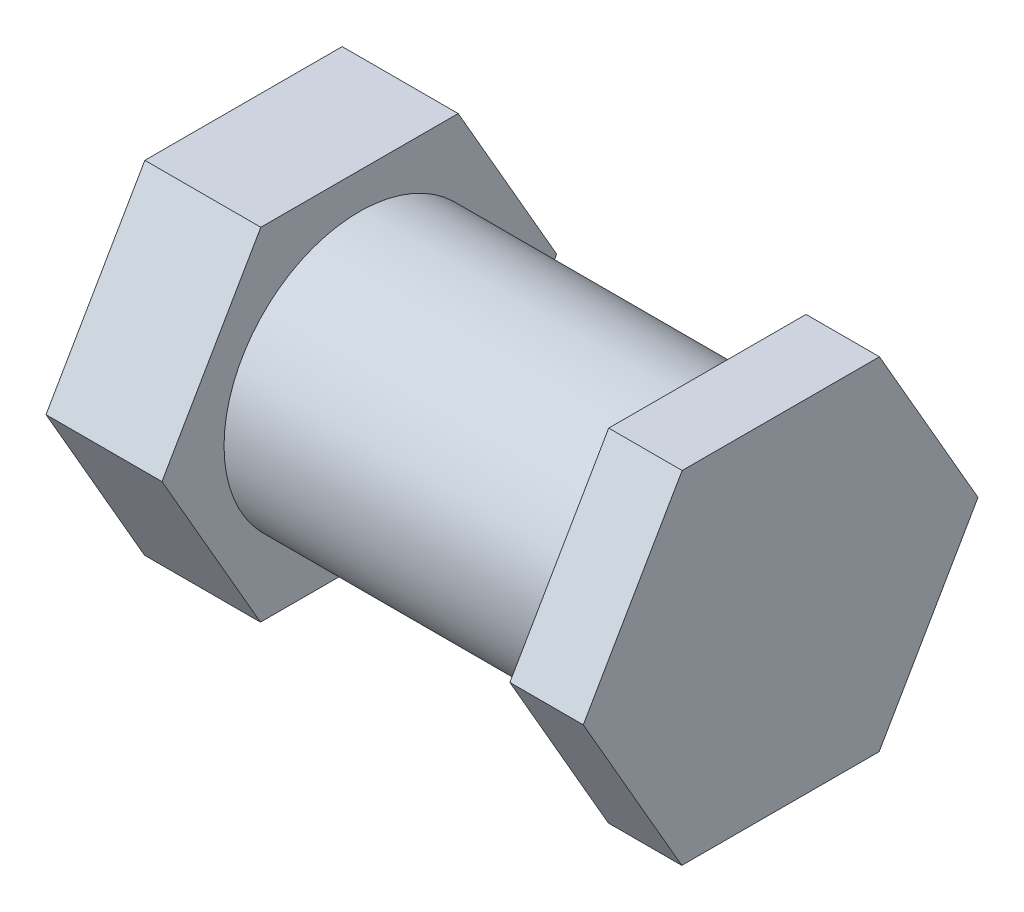
ISO-10303-21;
HEADER;
FILE_DESCRIPTION(('STEP AP214'),'2;1');
FILE_NAME('part.step','',(''),(''),'','','');
FILE_SCHEMA(('AUTOMOTIVE_DESIGN { 1 0 10303 214 1 1 1 1 }'));
ENDSEC;
DATA;
#1=APPLICATION_CONTEXT('core data for automotive mechanical design processes');
#2=APPLICATION_PROTOCOL_DEFINITION('international standard','automotive_design',2000,#1);
#3=PRODUCT_CONTEXT('',#1,'mechanical');
#4=PRODUCT('Part','Part','',(#3));
#5=PRODUCT_RELATED_PRODUCT_CATEGORY('part','',(#4));
#6=PRODUCT_DEFINITION_FORMATION('','',#4);
#7=PRODUCT_DEFINITION_CONTEXT('part definition',#1,'design');
#8=PRODUCT_DEFINITION('design','',#6,#7);
#9=PRODUCT_DEFINITION_SHAPE('','',#8);
#10=(LENGTH_UNIT() NAMED_UNIT(*) SI_UNIT(.MILLI.,.METRE.));
#11=(NAMED_UNIT(*) PLANE_ANGLE_UNIT() SI_UNIT($,.RADIAN.));
#12=(NAMED_UNIT(*) SI_UNIT($,.STERADIAN.) SOLID_ANGLE_UNIT());
#13=UNCERTAINTY_MEASURE_WITH_UNIT(LENGTH_MEASURE(1.E-05),#10,'distance_accuracy_value','');
#14=(GEOMETRIC_REPRESENTATION_CONTEXT(3) GLOBAL_UNCERTAINTY_ASSIGNED_CONTEXT((#13)) GLOBAL_UNIT_ASSIGNED_CONTEXT((#10,
#11,#12)) REPRESENTATION_CONTEXT('',''));
#15=CARTESIAN_POINT('',(0.,0.,0.));
#16=DIRECTION('',(0.,0.,1.));
#17=DIRECTION('',(1.,0.,0.));
#18=AXIS2_PLACEMENT_3D('',#15,#16,#17);
#19=CARTESIAN_POINT('',(61.4681732668994,7.55000000000085,260.861627804499));
#20=DIRECTION('',(1.,0.,0.));
#21=DIRECTION('',(0.,0.,-1.));
#22=AXIS2_PLACEMENT_3D('',#19,#20,#21);
#23=CYLINDRICAL_SURFACE('',#22,3.50000000000002);
#24=CARTESIAN_POINT('',(73.4681732668994,7.55000000000085,260.861627804499));
#25=DIRECTION('',(-1.,0.,0.));
#26=DIRECTION('',(0.,0.,1.));
#27=AXIS2_PLACEMENT_3D('',#24,#25,#26);
#28=CIRCLE('',#27,3.50000000000002);
#29=CARTESIAN_POINT('',(73.4681732668994,7.55000000000085,264.361627804499));
#30=VERTEX_POINT('',#29);
#31=EDGE_CURVE('E153',#30,#30,#28,.T.);
#32=ORIENTED_EDGE('',*,*,#31,.T.);
#33=EDGE_LOOP('',(#32));
#34=FACE_BOUND('',#33,.T.);
#35=CARTESIAN_POINT('',(64.4681732668994,7.55000000000085,260.861627804499));
#36=DIRECTION('',(-1.,0.,0.));
#37=DIRECTION('',(0.,0.,1.));
#38=AXIS2_PLACEMENT_3D('',#35,#36,#37);
#39=CIRCLE('',#38,3.50000000000002);
#40=CARTESIAN_POINT('',(64.4681732668994,7.55000000000085,264.361627804499));
#41=VERTEX_POINT('',#40);
#42=EDGE_CURVE('E11',#41,#41,#39,.T.);
#43=ORIENTED_EDGE('',*,*,#42,.F.);
#44=EDGE_LOOP('',(#43));
#45=FACE_BOUND('',#44,.T.);
#46=ADVANCED_FACE('F41',(#34,#45),#23,.T.);
#47=CARTESIAN_POINT('',(77.9802230516354,3.12569733058324,258.313100827745));
#48=DIRECTION('',(0.,-0.999999508501501,0.00099146192866746));
#49=DIRECTION('',(0.,-0.00099146192866746,-0.999999508501501));
#50=AXIS2_PLACEMENT_3D('',#47,#48,#49);
#51=PLANE('',#50);
#52=DIRECTION('',(0.,-0.00099146192866746,-0.999999508501501));
#53=VECTOR('',#52,1.);
#54=CARTESIAN_POINT('',(64.4681732668994,3.12569733058324,258.313100827745));
#55=LINE('',#54,#53);
#56=CARTESIAN_POINT('',(64.4681732668994,3.13075956119304,263.418922821869));
#57=VERTEX_POINT('',#56);
#58=CARTESIAN_POINT('',(64.4681732668994,3.12569733058324,258.313100827745));
#59=VERTEX_POINT('',#58);
#60=EDGE_CURVE('E175',#57,#59,#55,.T.);
#61=ORIENTED_EDGE('',*,*,#60,.F.);
#62=DIRECTION('',(-1.,0.,0.));
#63=VECTOR('',#62,1.);
#64=CARTESIAN_POINT('',(77.9802230516354,3.13075956119304,263.418922821869));
#65=LINE('',#64,#63);
#66=CARTESIAN_POINT('',(61.4681732668994,3.13075956119304,263.418922821869));
#67=VERTEX_POINT('',#66);
#68=EDGE_CURVE('E202',#57,#67,#65,.T.);
#69=ORIENTED_EDGE('',*,*,#68,.T.);
#70=DIRECTION('',(0.,0.00099146192866746,0.999999508501501));
#71=VECTOR('',#70,1.);
#72=CARTESIAN_POINT('',(61.4681732668994,3.12569733058324,258.313100827745));
#73=LINE('',#72,#71);
#74=CARTESIAN_POINT('',(61.4681732668994,3.12569733058324,258.313100827745));
#75=VERTEX_POINT('',#74);
#76=EDGE_CURVE('E158',#75,#67,#73,.T.);
#77=ORIENTED_EDGE('',*,*,#76,.F.);
#78=DIRECTION('',(-1.,0.,0.));
#79=VECTOR('',#78,1.);
#80=CARTESIAN_POINT('',(77.9802230516354,3.12569733058324,258.313100827745));
#81=LINE('',#80,#79);
#82=EDGE_CURVE('E166',#59,#75,#81,.T.);
#83=ORIENTED_EDGE('',*,*,#82,.F.);
#84=EDGE_LOOP('',(#61,#69,#77,#83));
#85=FACE_BOUND('',#84,.T.);
#86=ADVANCED_FACE('F229',(#85),#51,.T.);
#87=CARTESIAN_POINT('',(77.9802230516354,7.544937769391,255.755805810375));
#88=DIRECTION('',(0.,-0.500858385467864,-0.865529247169918));
#89=DIRECTION('',(0.,0.865529247169918,-0.500858385467864));
#90=AXIS2_PLACEMENT_3D('',#87,#88,#89);
#91=PLANE('',#90);
#92=DIRECTION('',(0.,0.865529247169918,-0.500858385467864));
#93=VECTOR('',#92,1.);
#94=CARTESIAN_POINT('',(64.4681732668994,7.544937769391,255.755805810375));
#95=LINE('',#94,#93);
#96=CARTESIAN_POINT('',(64.4681732668994,7.544937769391,255.755805810375));
#97=VERTEX_POINT('',#96);
#98=EDGE_CURVE('E172',#59,#97,#95,.T.);
#99=ORIENTED_EDGE('',*,*,#98,.F.);
#100=ORIENTED_EDGE('',*,*,#82,.T.);
#101=DIRECTION('',(0.,-0.865529247169918,0.500858385467864));
#102=VECTOR('',#101,1.);
#103=CARTESIAN_POINT('',(61.4681732668994,7.544937769391,255.755805810375));
#104=LINE('',#103,#102);
#105=CARTESIAN_POINT('',(61.4681732668994,7.544937769391,255.755805810375));
#106=VERTEX_POINT('',#105);
#107=EDGE_CURVE('E198',#106,#75,#104,.T.);
#108=ORIENTED_EDGE('',*,*,#107,.F.);
#109=DIRECTION('',(-1.,0.,0.));
#110=VECTOR('',#109,1.);
#111=CARTESIAN_POINT('',(77.9802230516354,7.544937769391,255.755805810375));
#112=LINE('',#111,#110);
#113=EDGE_CURVE('E205',#97,#106,#112,.T.);
#114=ORIENTED_EDGE('',*,*,#113,.F.);
#115=EDGE_LOOP('',(#99,#100,#108,#114));
#116=FACE_BOUND('',#115,.T.);
#117=ADVANCED_FACE('F240',(#116),#91,.T.);
#118=CARTESIAN_POINT('',(77.9802230516354,11.9692404388086,258.304332787129));
#119=DIRECTION('',(0.,0.499141123033644,-0.866520709098584));
#120=DIRECTION('',(0.,0.866520709098584,0.499141123033644));
#121=AXIS2_PLACEMENT_3D('',#118,#119,#120);
#122=PLANE('',#121);
#123=DIRECTION('',(0.,0.866520709098584,0.499141123033644));
#124=VECTOR('',#123,1.);
#125=CARTESIAN_POINT('',(64.4681732668994,11.9692404388086,258.304332787129));
#126=LINE('',#125,#124);
#127=CARTESIAN_POINT('',(64.4681732668994,11.9692404388086,258.304332787129));
#128=VERTEX_POINT('',#127);
#129=EDGE_CURVE('E169',#97,#128,#126,.T.);
#130=ORIENTED_EDGE('',*,*,#129,.F.);
#131=ORIENTED_EDGE('',*,*,#113,.T.);
#132=DIRECTION('',(0.,-0.866520709098584,-0.499141123033644));
#133=VECTOR('',#132,1.);
#134=CARTESIAN_POINT('',(61.4681732668994,11.9692404388086,258.304332787129));
#135=LINE('',#134,#133);
#136=CARTESIAN_POINT('',(61.4681732668994,11.9692404388086,258.304332787129));
#137=VERTEX_POINT('',#136);
#138=EDGE_CURVE('E194',#137,#106,#135,.T.);
#139=ORIENTED_EDGE('',*,*,#138,.F.);
#140=DIRECTION('',(-1.,0.,0.));
#141=VECTOR('',#140,1.);
#142=CARTESIAN_POINT('',(77.9802230516354,11.9692404388086,258.304332787129));
#143=LINE('',#142,#141);
#144=EDGE_CURVE('E208',#128,#137,#143,.T.);
#145=ORIENTED_EDGE('',*,*,#144,.F.);
#146=EDGE_LOOP('',(#130,#131,#139,#145));
#147=FACE_BOUND('',#146,.T.);
#148=ADVANCED_FACE('F244',(#147),#122,.T.);
#149=CARTESIAN_POINT('',(77.9802230516354,11.9743026694184,263.410154781253));
#150=DIRECTION('',(0.,0.999999508501501,-0.000991461928666452));
#151=DIRECTION('',(0.,0.000991461928666452,0.999999508501501));
#152=AXIS2_PLACEMENT_3D('',#149,#150,#151);
#153=PLANE('',#152);
#154=DIRECTION('',(0.,0.000991461928666452,0.999999508501501));
#155=VECTOR('',#154,1.);
#156=CARTESIAN_POINT('',(64.4681732668994,11.9743026694184,263.410154781253));
#157=LINE('',#156,#155);
#158=CARTESIAN_POINT('',(64.4681732668994,11.9743026694184,263.410154781253));
#159=VERTEX_POINT('',#158);
#160=EDGE_CURVE('E57',#128,#159,#157,.T.);
#161=ORIENTED_EDGE('',*,*,#160,.F.);
#162=ORIENTED_EDGE('',*,*,#144,.T.);
#163=DIRECTION('',(0.,-0.000991461928666452,-0.999999508501501));
#164=VECTOR('',#163,1.);
#165=CARTESIAN_POINT('',(61.4681732668994,11.9743026694184,263.410154781253));
#166=LINE('',#165,#164);
#167=CARTESIAN_POINT('',(61.4681732668994,11.9743026694184,263.410154781253));
#168=VERTEX_POINT('',#167);
#169=EDGE_CURVE('E190',#168,#137,#166,.T.);
#170=ORIENTED_EDGE('',*,*,#169,.F.);
#171=DIRECTION('',(-1.,0.,0.));
#172=VECTOR('',#171,1.);
#173=CARTESIAN_POINT('',(77.9802230516354,11.9743026694184,263.410154781253));
#174=LINE('',#173,#172);
#175=EDGE_CURVE('E211',#159,#168,#174,.T.);
#176=ORIENTED_EDGE('',*,*,#175,.F.);
#177=EDGE_LOOP('',(#161,#162,#170,#176));
#178=FACE_BOUND('',#177,.T.);
#179=ADVANCED_FACE('F247',(#178),#153,.T.);
#180=CARTESIAN_POINT('',(77.9802230516354,7.55506223061062,265.967449798623));
#181=DIRECTION('',(0.,0.500858385467863,0.865529247169919));
#182=DIRECTION('',(0.,-0.865529247169919,0.500858385467863));
#183=AXIS2_PLACEMENT_3D('',#180,#181,#182);
#184=PLANE('',#183);
#185=DIRECTION('',(0.,-0.865529247169919,0.500858385467863));
#186=VECTOR('',#185,1.);
#187=CARTESIAN_POINT('',(64.4681732668994,7.55506223061062,265.967449798623));
#188=LINE('',#187,#186);
#189=CARTESIAN_POINT('',(64.4681732668994,7.55506223061062,265.967449798623));
#190=VERTEX_POINT('',#189);
#191=EDGE_CURVE('E163',#159,#190,#188,.T.);
#192=ORIENTED_EDGE('',*,*,#191,.F.);
#193=ORIENTED_EDGE('',*,*,#175,.T.);
#194=DIRECTION('',(0.,0.865529247169919,-0.500858385467863));
#195=VECTOR('',#194,1.);
#196=CARTESIAN_POINT('',(61.4681732668994,7.55506223061062,265.967449798623));
#197=LINE('',#196,#195);
#198=CARTESIAN_POINT('',(61.4681732668994,7.55506223061062,265.967449798623));
#199=VERTEX_POINT('',#198);
#200=EDGE_CURVE('E186',#199,#168,#197,.T.);
#201=ORIENTED_EDGE('',*,*,#200,.F.);
#202=DIRECTION('',(-1.,0.,0.));
#203=VECTOR('',#202,1.);
#204=CARTESIAN_POINT('',(77.9802230516354,7.55506223061062,265.967449798623));
#205=LINE('',#204,#203);
#206=EDGE_CURVE('E214',#190,#199,#205,.T.);
#207=ORIENTED_EDGE('',*,*,#206,.F.);
#208=EDGE_LOOP('',(#192,#193,#201,#207));
#209=FACE_BOUND('',#208,.T.);
#210=ADVANCED_FACE('F250',(#209),#184,.T.);
#211=CARTESIAN_POINT('',(77.9802230516354,3.13075956119304,263.418922821869));
#212=DIRECTION('',(0.,-0.499141123033637,0.866520709098588));
#213=DIRECTION('',(0.,-0.866520709098588,-0.499141123033637));
#214=AXIS2_PLACEMENT_3D('',#211,#212,#213);
#215=PLANE('',#214);
#216=DIRECTION('',(0.,-0.866520709098588,-0.499141123033637));
#217=VECTOR('',#216,1.);
#218=CARTESIAN_POINT('',(64.4681732668994,3.13075956119304,263.418922821869));
#219=LINE('',#218,#217);
#220=EDGE_CURVE('E50',#190,#57,#219,.T.);
#221=ORIENTED_EDGE('',*,*,#220,.F.);
#222=ORIENTED_EDGE('',*,*,#206,.T.);
#223=DIRECTION('',(0.,0.866520709098588,0.499141123033637));
#224=VECTOR('',#223,1.);
#225=CARTESIAN_POINT('',(61.4681732668994,3.13075956119304,263.418922821869));
#226=LINE('',#225,#224);
#227=EDGE_CURVE('E182',#67,#199,#226,.T.);
#228=ORIENTED_EDGE('',*,*,#227,.F.);
#229=ORIENTED_EDGE('',*,*,#68,.F.);
#230=EDGE_LOOP('',(#221,#222,#228,#229));
#231=FACE_BOUND('',#230,.T.);
#232=ADVANCED_FACE('F232',(#231),#215,.T.);
#233=CARTESIAN_POINT('',(64.4681732668994,0.,0.));
#234=DIRECTION('',(-1.,0.,0.));
#235=DIRECTION('',(0.,0.,1.));
#236=AXIS2_PLACEMENT_3D('',#233,#234,#235);
#237=PLANE('',#236);
#238=ORIENTED_EDGE('',*,*,#42,.T.);
#239=EDGE_LOOP('',(#238));
#240=FACE_BOUND('',#239,.T.);
#241=ORIENTED_EDGE('',*,*,#60,.T.);
#242=ORIENTED_EDGE('',*,*,#98,.T.);
#243=ORIENTED_EDGE('',*,*,#129,.T.);
#244=ORIENTED_EDGE('',*,*,#160,.T.);
#245=ORIENTED_EDGE('',*,*,#191,.T.);
#246=ORIENTED_EDGE('',*,*,#220,.T.);
#247=EDGE_LOOP('',(#241,#242,#243,#244,#245,#246));
#248=FACE_BOUND('',#247,.T.);
#249=ADVANCED_FACE('F222',(#240,#248),#237,.F.);
#250=CARTESIAN_POINT('',(61.4681732668994,7.55000000000085,260.861627804499));
#251=DIRECTION('',(-1.,0.,0.));
#252=DIRECTION('',(0.,0.,1.));
#253=AXIS2_PLACEMENT_3D('',#250,#251,#252);
#254=PLANE('',#253);
#255=ORIENTED_EDGE('',*,*,#76,.T.);
#256=ORIENTED_EDGE('',*,*,#227,.T.);
#257=ORIENTED_EDGE('',*,*,#200,.T.);
#258=ORIENTED_EDGE('',*,*,#169,.T.);
#259=ORIENTED_EDGE('',*,*,#138,.T.);
#260=ORIENTED_EDGE('',*,*,#107,.T.);
#261=EDGE_LOOP('',(#255,#256,#257,#258,#259,#260));
#262=FACE_BOUND('',#261,.T.);
#263=ADVANCED_FACE('F235',(#262),#254,.T.);
#264=CARTESIAN_POINT('',(75.3681732668994,3.13075956119307,263.418922821869));
#265=DIRECTION('',(0.,0.999999508501501,-0.000991461928665029));
#266=DIRECTION('',(0.,0.000991461928665029,0.999999508501501));
#267=AXIS2_PLACEMENT_3D('',#264,#265,#266);
#268=PLANE('',#267);
#269=DIRECTION('',(0.,-0.000991461928665029,-0.999999508501501));
#270=VECTOR('',#269,1.);
#271=CARTESIAN_POINT('',(73.4681732668994,3.13075956119307,263.418922821869));
#272=LINE('',#271,#270);
#273=CARTESIAN_POINT('',(73.4681732668994,3.13075956119307,263.418922821869));
#274=VERTEX_POINT('',#273);
#275=CARTESIAN_POINT('',(73.4681732668994,3.12569733058328,258.313100827745));
#276=VERTEX_POINT('',#275);
#277=EDGE_CURVE('E151',#274,#276,#272,.T.);
#278=ORIENTED_EDGE('',*,*,#277,.T.);
#279=DIRECTION('',(-1.,0.,0.));
#280=VECTOR('',#279,1.);
#281=CARTESIAN_POINT('',(75.3681732668994,3.12569733058328,258.313100827745));
#282=LINE('',#281,#280);
#283=CARTESIAN_POINT('',(75.3681732668994,3.12569733058328,258.313100827745));
#284=VERTEX_POINT('',#283);
#285=EDGE_CURVE('E129',#284,#276,#282,.T.);
#286=ORIENTED_EDGE('',*,*,#285,.F.);
#287=DIRECTION('',(0.,-0.000991461928665029,-0.999999508501501));
#288=VECTOR('',#287,1.);
#289=CARTESIAN_POINT('',(75.3681732668994,3.13075956119307,263.418922821869));
#290=LINE('',#289,#288);
#291=CARTESIAN_POINT('',(75.3681732668994,3.13075956119307,263.418922821869));
#292=VERTEX_POINT('',#291);
#293=EDGE_CURVE('E137',#292,#284,#290,.T.);
#294=ORIENTED_EDGE('',*,*,#293,.F.);
#295=DIRECTION('',(-1.,0.,0.));
#296=VECTOR('',#295,1.);
#297=CARTESIAN_POINT('',(75.3681732668994,3.13075956119307,263.418922821869));
#298=LINE('',#297,#296);
#299=EDGE_CURVE('E408',#292,#274,#298,.T.);
#300=ORIENTED_EDGE('',*,*,#299,.T.);
#301=EDGE_LOOP('',(#278,#286,#294,#300));
#302=FACE_BOUND('',#301,.T.);
#303=ADVANCED_FACE('F149',(#302),#268,.F.);
#304=CARTESIAN_POINT('',(75.3681732668994,3.12569733058328,258.313100827745));
#305=DIRECTION('',(0.,0.50085838546787,0.865529247169914));
#306=DIRECTION('',(0.,-0.865529247169914,0.50085838546787));
#307=AXIS2_PLACEMENT_3D('',#304,#305,#306);
#308=PLANE('',#307);
#309=DIRECTION('',(0.,0.865529247169914,-0.50085838546787));
#310=VECTOR('',#309,1.);
#311=CARTESIAN_POINT('',(73.4681732668994,3.12569733058328,258.313100827745));
#312=LINE('',#311,#310);
#313=CARTESIAN_POINT('',(73.4681732668994,7.54493776939107,255.755805810375));
#314=VERTEX_POINT('',#313);
#315=EDGE_CURVE('E389',#276,#314,#312,.T.);
#316=ORIENTED_EDGE('',*,*,#315,.T.);
#317=DIRECTION('',(-1.,0.,0.));
#318=VECTOR('',#317,1.);
#319=CARTESIAN_POINT('',(75.3681732668994,7.54493776939107,255.755805810375));
#320=LINE('',#319,#318);
#321=CARTESIAN_POINT('',(75.3681732668994,7.54493776939107,255.755805810375));
#322=VERTEX_POINT('',#321);
#323=EDGE_CURVE('E132',#322,#314,#320,.T.);
#324=ORIENTED_EDGE('',*,*,#323,.F.);
#325=DIRECTION('',(0.,0.865529247169914,-0.50085838546787));
#326=VECTOR('',#325,1.);
#327=CARTESIAN_POINT('',(75.3681732668994,3.12569733058328,258.313100827745));
#328=LINE('',#327,#326);
#329=EDGE_CURVE('E125',#284,#322,#328,.T.);
#330=ORIENTED_EDGE('',*,*,#329,.F.);
#331=ORIENTED_EDGE('',*,*,#285,.T.);
#332=EDGE_LOOP('',(#316,#324,#330,#331));
#333=FACE_BOUND('',#332,.T.);
#334=ADVANCED_FACE('F127',(#333),#308,.F.);
#335=CARTESIAN_POINT('',(75.3681732668994,7.54493776939107,255.755805810375));
#336=DIRECTION('',(0.,-0.49914112303364,0.866520709098586));
#337=DIRECTION('',(0.,-0.866520709098587,-0.49914112303364));
#338=AXIS2_PLACEMENT_3D('',#335,#336,#337);
#339=PLANE('',#338);
#340=DIRECTION('',(0.,0.866520709098586,0.49914112303364));
#341=VECTOR('',#340,1.);
#342=CARTESIAN_POINT('',(73.4681732668994,7.54493776939107,255.755805810375));
#343=LINE('',#342,#341);
#344=CARTESIAN_POINT('',(73.4681732668994,11.9692404388086,258.304332787129));
#345=VERTEX_POINT('',#344);
#346=EDGE_CURVE('E393',#314,#345,#343,.T.);
#347=ORIENTED_EDGE('',*,*,#346,.T.);
#348=DIRECTION('',(-1.,0.,0.));
#349=VECTOR('',#348,1.);
#350=CARTESIAN_POINT('',(75.3681732668994,11.9692404388086,258.304332787129));
#351=LINE('',#350,#349);
#352=CARTESIAN_POINT('',(75.3681732668994,11.9692404388086,258.304332787129));
#353=VERTEX_POINT('',#352);
#354=EDGE_CURVE('E159',#353,#345,#351,.T.);
#355=ORIENTED_EDGE('',*,*,#354,.F.);
#356=DIRECTION('',(0.,0.866520709098586,0.49914112303364));
#357=VECTOR('',#356,1.);
#358=CARTESIAN_POINT('',(75.3681732668994,7.54493776939107,255.755805810375));
#359=LINE('',#358,#357);
#360=EDGE_CURVE('E136',#322,#353,#359,.T.);
#361=ORIENTED_EDGE('',*,*,#360,.F.);
#362=ORIENTED_EDGE('',*,*,#323,.T.);
#363=EDGE_LOOP('',(#347,#355,#361,#362));
#364=FACE_BOUND('',#363,.T.);
#365=ADVANCED_FACE('F325',(#364),#339,.F.);
#366=CARTESIAN_POINT('',(75.3681732668994,11.9692404388086,258.304332787129));
#367=DIRECTION('',(0.,-0.999999508501501,0.000991461928664742));
#368=DIRECTION('',(0.,-0.000991461928664742,-0.999999508501501));
#369=AXIS2_PLACEMENT_3D('',#366,#367,#368);
#370=PLANE('',#369);
#371=DIRECTION('',(0.,0.000991461928664742,0.999999508501501));
#372=VECTOR('',#371,1.);
#373=CARTESIAN_POINT('',(73.4681732668994,11.9692404388086,258.304332787129));
#374=LINE('',#373,#372);
#375=CARTESIAN_POINT('',(73.4681732668994,11.9743026694184,263.410154781253));
#376=VERTEX_POINT('',#375);
#377=EDGE_CURVE('E400',#345,#376,#374,.T.);
#378=ORIENTED_EDGE('',*,*,#377,.T.);
#379=DIRECTION('',(-1.,0.,0.));
#380=VECTOR('',#379,1.);
#381=CARTESIAN_POINT('',(75.3681732668994,11.9743026694184,263.410154781253));
#382=LINE('',#381,#380);
#383=CARTESIAN_POINT('',(75.3681732668994,11.9743026694184,263.410154781253));
#384=VERTEX_POINT('',#383);
#385=EDGE_CURVE('E415',#384,#376,#382,.T.);
#386=ORIENTED_EDGE('',*,*,#385,.F.);
#387=DIRECTION('',(0.,0.000991461928664742,0.999999508501501));
#388=VECTOR('',#387,1.);
#389=CARTESIAN_POINT('',(75.3681732668994,11.9692404388086,258.304332787129));
#390=LINE('',#389,#388);
#391=EDGE_CURVE('E424',#353,#384,#390,.T.);
#392=ORIENTED_EDGE('',*,*,#391,.F.);
#393=ORIENTED_EDGE('',*,*,#354,.T.);
#394=EDGE_LOOP('',(#378,#386,#392,#393));
#395=FACE_BOUND('',#394,.T.);
#396=ADVANCED_FACE('F333',(#395),#370,.F.);
#397=CARTESIAN_POINT('',(75.3681732668994,11.9743026694184,263.410154781253));
#398=DIRECTION('',(0.,-0.500858385467859,-0.865529247169921));
#399=DIRECTION('',(0.,0.865529247169921,-0.500858385467859));
#400=AXIS2_PLACEMENT_3D('',#397,#398,#399);
#401=PLANE('',#400);
#402=DIRECTION('',(0.,-0.86552924716992,0.500858385467859));
#403=VECTOR('',#402,1.);
#404=CARTESIAN_POINT('',(73.4681732668994,11.9743026694184,263.410154781253));
#405=LINE('',#404,#403);
#406=CARTESIAN_POINT('',(73.4681732668994,7.55506223061069,265.967449798623));
#407=VERTEX_POINT('',#406);
#408=EDGE_CURVE('E403',#376,#407,#405,.T.);
#409=ORIENTED_EDGE('',*,*,#408,.T.);
#410=DIRECTION('',(-1.,0.,0.));
#411=VECTOR('',#410,1.);
#412=CARTESIAN_POINT('',(75.3681732668994,7.55506223061069,265.967449798623));
#413=LINE('',#412,#411);
#414=CARTESIAN_POINT('',(75.3681732668994,7.55506223061069,265.967449798623));
#415=VERTEX_POINT('',#414);
#416=EDGE_CURVE('E411',#415,#407,#413,.T.);
#417=ORIENTED_EDGE('',*,*,#416,.F.);
#418=DIRECTION('',(0.,-0.86552924716992,0.500858385467859));
#419=VECTOR('',#418,1.);
#420=CARTESIAN_POINT('',(75.3681732668994,11.9743026694184,263.410154781253));
#421=LINE('',#420,#419);
#422=EDGE_CURVE('E428',#384,#415,#421,.T.);
#423=ORIENTED_EDGE('',*,*,#422,.F.);
#424=ORIENTED_EDGE('',*,*,#385,.T.);
#425=EDGE_LOOP('',(#409,#417,#423,#424));
#426=FACE_BOUND('',#425,.T.);
#427=ADVANCED_FACE('F343',(#426),#401,.F.);
#428=CARTESIAN_POINT('',(75.3681732668994,7.55506223061069,265.967449798623));
#429=DIRECTION('',(0.,0.499141123033642,-0.866520709098585));
#430=DIRECTION('',(0.,0.866520709098585,0.499141123033642));
#431=AXIS2_PLACEMENT_3D('',#428,#429,#430);
#432=PLANE('',#431);
#433=DIRECTION('',(0.,-0.866520709098585,-0.499141123033642));
#434=VECTOR('',#433,1.);
#435=CARTESIAN_POINT('',(73.4681732668994,7.55506223061069,265.967449798623));
#436=LINE('',#435,#434);
#437=EDGE_CURVE('E147',#407,#274,#436,.T.);
#438=ORIENTED_EDGE('',*,*,#437,.T.);
#439=ORIENTED_EDGE('',*,*,#299,.F.);
#440=DIRECTION('',(0.,-0.866520709098585,-0.499141123033642));
#441=VECTOR('',#440,1.);
#442=CARTESIAN_POINT('',(75.3681732668994,7.55506223061069,265.967449798623));
#443=LINE('',#442,#441);
#444=EDGE_CURVE('E142',#415,#292,#443,.T.);
#445=ORIENTED_EDGE('',*,*,#444,.F.);
#446=ORIENTED_EDGE('',*,*,#416,.T.);
#447=EDGE_LOOP('',(#438,#439,#445,#446));
#448=FACE_BOUND('',#447,.T.);
#449=ADVANCED_FACE('F353',(#448),#432,.F.);
#450=CARTESIAN_POINT('',(75.3681732668994,0.,0.));
#451=DIRECTION('',(1.,0.,0.));
#452=DIRECTION('',(0.,0.,-1.));
#453=AXIS2_PLACEMENT_3D('',#450,#451,#452);
#454=PLANE('',#453);
#455=ORIENTED_EDGE('',*,*,#293,.T.);
#456=ORIENTED_EDGE('',*,*,#329,.T.);
#457=ORIENTED_EDGE('',*,*,#360,.T.);
#458=ORIENTED_EDGE('',*,*,#391,.T.);
#459=ORIENTED_EDGE('',*,*,#422,.T.);
#460=ORIENTED_EDGE('',*,*,#444,.T.);
#461=EDGE_LOOP('',(#455,#456,#457,#458,#459,#460));
#462=FACE_BOUND('',#461,.T.);
#463=ADVANCED_FACE('F140',(#462),#454,.T.);
#464=CARTESIAN_POINT('',(73.4681732668994,0.,0.));
#465=DIRECTION('',(1.,0.,0.));
#466=DIRECTION('',(0.,0.,-1.));
#467=AXIS2_PLACEMENT_3D('',#464,#465,#466);
#468=PLANE('',#467);
#469=ORIENTED_EDGE('',*,*,#31,.F.);
#470=EDGE_LOOP('',(#469));
#471=FACE_BOUND('',#470,.T.);
#472=ORIENTED_EDGE('',*,*,#277,.F.);
#473=ORIENTED_EDGE('',*,*,#437,.F.);
#474=ORIENTED_EDGE('',*,*,#408,.F.);
#475=ORIENTED_EDGE('',*,*,#377,.F.);
#476=ORIENTED_EDGE('',*,*,#346,.F.);
#477=ORIENTED_EDGE('',*,*,#315,.F.);
#478=EDGE_LOOP('',(#472,#473,#474,#475,#476,#477));
#479=FACE_BOUND('',#478,.T.);
#480=ADVANCED_FACE('F372',(#471,#479),#468,.F.);
#481=CLOSED_SHELL('',(#46,#86,#117,#148,#179,#210,#232,#249,#263,#303,#334,#365,#396,#427,#449,
#463,#480));
#482=MANIFOLD_SOLID_BREP('B2',#481);
#483=ADVANCED_BREP_SHAPE_REPRESENTATION('',(#18,#482),#14);
#484=SHAPE_DEFINITION_REPRESENTATION(#9,#483);
ENDSEC;
END-ISO-10303-21;
